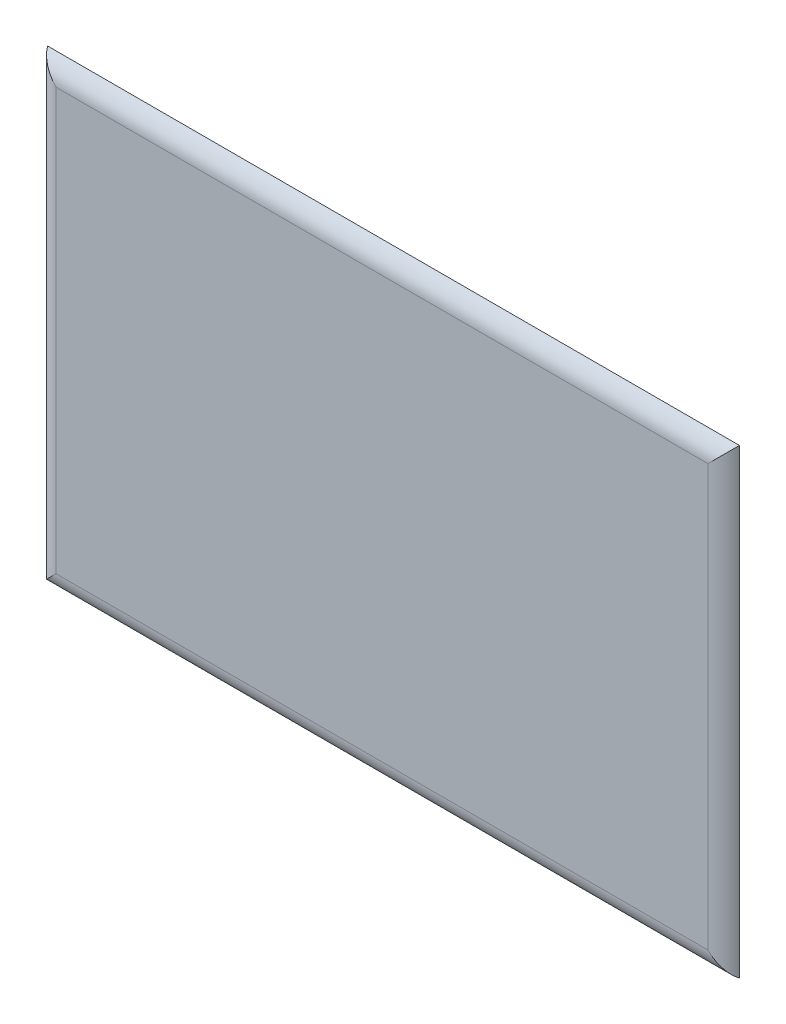
ISO-10303-21;
HEADER;
FILE_DESCRIPTION(('STEP AP214'),'2;1');
FILE_NAME('part.step','',(''),(''),'','','');
FILE_SCHEMA(('AUTOMOTIVE_DESIGN { 1 0 10303 214 1 1 1 1 }'));
ENDSEC;
DATA;
#1=APPLICATION_CONTEXT('core data for automotive mechanical design processes');
#2=APPLICATION_PROTOCOL_DEFINITION('international standard','automotive_design',2000,#1);
#3=PRODUCT_CONTEXT('',#1,'mechanical');
#4=PRODUCT('Part','Part','',(#3));
#5=PRODUCT_RELATED_PRODUCT_CATEGORY('part','',(#4));
#6=PRODUCT_DEFINITION_FORMATION('','',#4);
#7=PRODUCT_DEFINITION_CONTEXT('part definition',#1,'design');
#8=PRODUCT_DEFINITION('design','',#6,#7);
#9=PRODUCT_DEFINITION_SHAPE('','',#8);
#10=(LENGTH_UNIT() NAMED_UNIT(*) SI_UNIT(.MILLI.,.METRE.));
#11=(NAMED_UNIT(*) PLANE_ANGLE_UNIT() SI_UNIT($,.RADIAN.));
#12=(NAMED_UNIT(*) SI_UNIT($,.STERADIAN.) SOLID_ANGLE_UNIT());
#13=UNCERTAINTY_MEASURE_WITH_UNIT(LENGTH_MEASURE(1.E-05),#10,'distance_accuracy_value','');
#14=(GEOMETRIC_REPRESENTATION_CONTEXT(3) GLOBAL_UNCERTAINTY_ASSIGNED_CONTEXT((#13)) GLOBAL_UNIT_ASSIGNED_CONTEXT((#10,
#11,#12)) REPRESENTATION_CONTEXT('',''));
#15=CARTESIAN_POINT('',(0.,0.,0.));
#16=DIRECTION('',(0.,0.,1.));
#17=DIRECTION('',(1.,0.,0.));
#18=AXIS2_PLACEMENT_3D('',#15,#16,#17);
#19=CARTESIAN_POINT('',(0.,0.,5.));
#20=DIRECTION('',(0.,0.,1.));
#21=DIRECTION('',(1.,0.,0.));
#22=AXIS2_PLACEMENT_3D('',#19,#20,#21);
#23=PLANE('',#22);
#24=DIRECTION('',(1.,0.,0.));
#25=VECTOR('',#24,1.);
#26=CARTESIAN_POINT('',(-97.6493407970121,18.4942891659189,5.));
#27=LINE('',#26,#25);
#28=CARTESIAN_POINT('',(193.690405165143,18.4942891659189,5.));
#29=VERTEX_POINT('',#28);
#30=CARTESIAN_POINT('',(-88.9890867591677,18.4942891659189,5.));
#31=VERTEX_POINT('',#30);
#32=EDGE_CURVE('E104',#29,#31,#27,.F.);
#33=ORIENTED_EDGE('',*,*,#32,.T.);
#34=DIRECTION('',(0.,1.,0.));
#35=VECTOR('',#34,1.);
#36=CARTESIAN_POINT('',(-88.9890867591677,-172.845456796237,5.));
#37=LINE('',#36,#35);
#38=CARTESIAN_POINT('',(-88.9890867591677,-164.185202758392,5.));
#39=VERTEX_POINT('',#38);
#40=EDGE_CURVE('E11',#31,#39,#37,.F.);
#41=ORIENTED_EDGE('',*,*,#40,.T.);
#42=DIRECTION('',(-1.,0.,0.));
#43=VECTOR('',#42,1.);
#44=CARTESIAN_POINT('',(202.350659202988,-164.185202758392,5.));
#45=LINE('',#44,#43);
#46=CARTESIAN_POINT('',(193.690405165143,-164.185202758392,5.));
#47=VERTEX_POINT('',#46);
#48=EDGE_CURVE('E45',#39,#47,#45,.F.);
#49=ORIENTED_EDGE('',*,*,#48,.T.);
#50=DIRECTION('',(0.,-1.,0.));
#51=VECTOR('',#50,1.);
#52=CARTESIAN_POINT('',(193.690405165143,27.1545432037633,5.));
#53=LINE('',#52,#51);
#54=EDGE_CURVE('E106',#47,#29,#53,.F.);
#55=ORIENTED_EDGE('',*,*,#54,.T.);
#56=EDGE_LOOP('',(#33,#41,#49,#55));
#57=FACE_BOUND('',#56,.T.);
#58=ADVANCED_FACE('F36',(#57),#23,.T.);
#59=CARTESIAN_POINT('',(0.,0.,0.));
#60=DIRECTION('',(0.,0.,1.));
#61=DIRECTION('',(1.,0.,0.));
#62=AXIS2_PLACEMENT_3D('',#59,#60,#61);
#63=PLANE('',#62);
#64=DIRECTION('',(0.,-1.,0.));
#65=VECTOR('',#64,1.);
#66=CARTESIAN_POINT('',(-97.6493407970121,27.1545432037633,0.));
#67=LINE('',#66,#65);
#68=CARTESIAN_POINT('',(-97.6493407970121,27.1545432037633,0.));
#69=VERTEX_POINT('',#68);
#70=CARTESIAN_POINT('',(-97.6493407970121,-172.845456796237,0.));
#71=VERTEX_POINT('',#70);
#72=EDGE_CURVE('E81',#69,#71,#67,.T.);
#73=ORIENTED_EDGE('',*,*,#72,.F.);
#74=DIRECTION('',(-1.,0.,0.));
#75=VECTOR('',#74,1.);
#76=CARTESIAN_POINT('',(-97.6493407970121,27.1545432037633,0.));
#77=LINE('',#76,#75);
#78=CARTESIAN_POINT('',(202.350659202988,27.1545432037633,0.));
#79=VERTEX_POINT('',#78);
#80=EDGE_CURVE('E103',#79,#69,#77,.T.);
#81=ORIENTED_EDGE('',*,*,#80,.F.);
#82=DIRECTION('',(0.,1.,0.));
#83=VECTOR('',#82,1.);
#84=CARTESIAN_POINT('',(202.350659202988,27.1545432037633,0.));
#85=LINE('',#84,#83);
#86=CARTESIAN_POINT('',(202.350659202988,-172.845456796237,0.));
#87=VERTEX_POINT('',#86);
#88=EDGE_CURVE('E83',#87,#79,#85,.T.);
#89=ORIENTED_EDGE('',*,*,#88,.F.);
#90=DIRECTION('',(1.,0.,0.));
#91=VECTOR('',#90,1.);
#92=CARTESIAN_POINT('',(-97.6493407970121,-172.845456796237,0.));
#93=LINE('',#92,#91);
#94=EDGE_CURVE('E79',#71,#87,#93,.T.);
#95=ORIENTED_EDGE('',*,*,#94,.F.);
#96=EDGE_LOOP('',(#73,#81,#89,#95));
#97=FACE_BOUND('',#96,.T.);
#98=ADVANCED_FACE('F80',(#97),#63,.F.);
#99=CARTESIAN_POINT('',(193.690405165143,27.1545432037633,-5.));
#100=DIRECTION('',(0.,1.,0.));
#101=DIRECTION('',(-1.,0.,0.));
#102=AXIS2_PLACEMENT_3D('',#99,#100,#101);
#103=CYLINDRICAL_SURFACE('',#102,10.);
#104=CARTESIAN_POINT('',(193.690405165144,-164.185202758392,-5.));
#105=DIRECTION('',(0.707106781186547,0.707106781186548,0.));
#106=DIRECTION('',(-0.707106781186548,0.707106781186547,0.));
#107=AXIS2_PLACEMENT_3D('',#104,#105,#106);
#108=ELLIPSE('',#107,14.142135623731,10.);
#109=EDGE_CURVE('E95',#87,#47,#108,.F.);
#110=ORIENTED_EDGE('',*,*,#109,.F.);
#111=ORIENTED_EDGE('',*,*,#88,.T.);
#112=CARTESIAN_POINT('',(193.690405165143,18.4942891659189,-5.));
#113=DIRECTION('',(-0.707106781186548,0.707106781186547,0.));
#114=DIRECTION('',(-0.707106781186547,-0.707106781186548,0.));
#115=AXIS2_PLACEMENT_3D('',#112,#113,#114);
#116=ELLIPSE('',#115,14.1421356237309,10.);
#117=EDGE_CURVE('E40',#29,#79,#116,.T.);
#118=ORIENTED_EDGE('',*,*,#117,.F.);
#119=ORIENTED_EDGE('',*,*,#54,.F.);
#120=EDGE_LOOP('',(#110,#111,#118,#119));
#121=FACE_BOUND('',#120,.T.);
#122=ADVANCED_FACE('F38',(#121),#103,.T.);
#123=CARTESIAN_POINT('',(-97.6493407970121,18.4942891659189,-5.));
#124=DIRECTION('',(-1.,0.,0.));
#125=DIRECTION('',(0.,0.,1.));
#126=AXIS2_PLACEMENT_3D('',#123,#124,#125);
#127=CYLINDRICAL_SURFACE('',#126,10.);
#128=ORIENTED_EDGE('',*,*,#117,.T.);
#129=ORIENTED_EDGE('',*,*,#80,.T.);
#130=CARTESIAN_POINT('',(-88.9890867591677,18.4942891659189,-5.));
#131=DIRECTION('',(-0.707106781186547,-0.707106781186548,0.));
#132=DIRECTION('',(-0.707106781186547,0.707106781186547,0.));
#133=AXIS2_PLACEMENT_3D('',#130,#131,#132);
#134=ELLIPSE('',#133,14.142135623731,10.);
#135=EDGE_CURVE('E90',#31,#69,#134,.T.);
#136=ORIENTED_EDGE('',*,*,#135,.F.);
#137=ORIENTED_EDGE('',*,*,#32,.F.);
#138=EDGE_LOOP('',(#128,#129,#136,#137));
#139=FACE_BOUND('',#138,.T.);
#140=ADVANCED_FACE('F102',(#139),#127,.T.);
#141=CARTESIAN_POINT('',(-97.6493407970121,-164.185202758392,-5.));
#142=DIRECTION('',(1.,0.,0.));
#143=DIRECTION('',(0.,0.,-1.));
#144=AXIS2_PLACEMENT_3D('',#141,#142,#143);
#145=CYLINDRICAL_SURFACE('',#144,10.);
#146=ORIENTED_EDGE('',*,*,#109,.T.);
#147=ORIENTED_EDGE('',*,*,#48,.F.);
#148=CARTESIAN_POINT('',(-88.9890867591677,-164.185202758392,-5.));
#149=DIRECTION('',(0.707106781186547,-0.707106781186547,0.));
#150=DIRECTION('',(0.707106781186547,0.707106781186548,0.));
#151=AXIS2_PLACEMENT_3D('',#148,#149,#150);
#152=ELLIPSE('',#151,14.1421356237309,10.);
#153=EDGE_CURVE('E53',#71,#39,#152,.F.);
#154=ORIENTED_EDGE('',*,*,#153,.F.);
#155=ORIENTED_EDGE('',*,*,#94,.T.);
#156=EDGE_LOOP('',(#146,#147,#154,#155));
#157=FACE_BOUND('',#156,.T.);
#158=ADVANCED_FACE('F93',(#157),#145,.T.);
#159=CARTESIAN_POINT('',(-88.9890867591677,27.1545432037633,-5.));
#160=DIRECTION('',(0.,-1.,0.));
#161=DIRECTION('',(1.,0.,0.));
#162=AXIS2_PLACEMENT_3D('',#159,#160,#161);
#163=CYLINDRICAL_SURFACE('',#162,10.);
#164=ORIENTED_EDGE('',*,*,#135,.T.);
#165=ORIENTED_EDGE('',*,*,#72,.T.);
#166=ORIENTED_EDGE('',*,*,#153,.T.);
#167=ORIENTED_EDGE('',*,*,#40,.F.);
#168=EDGE_LOOP('',(#164,#165,#166,#167));
#169=FACE_BOUND('',#168,.T.);
#170=ADVANCED_FACE('F88',(#169),#163,.T.);
#171=CLOSED_SHELL('',(#58,#98,#122,#140,#158,#170));
#172=MANIFOLD_SOLID_BREP('B2',#171);
#173=ADVANCED_BREP_SHAPE_REPRESENTATION('',(#18,#172),#14);
#174=SHAPE_DEFINITION_REPRESENTATION(#9,#173);
ENDSEC;
END-ISO-10303-21;
